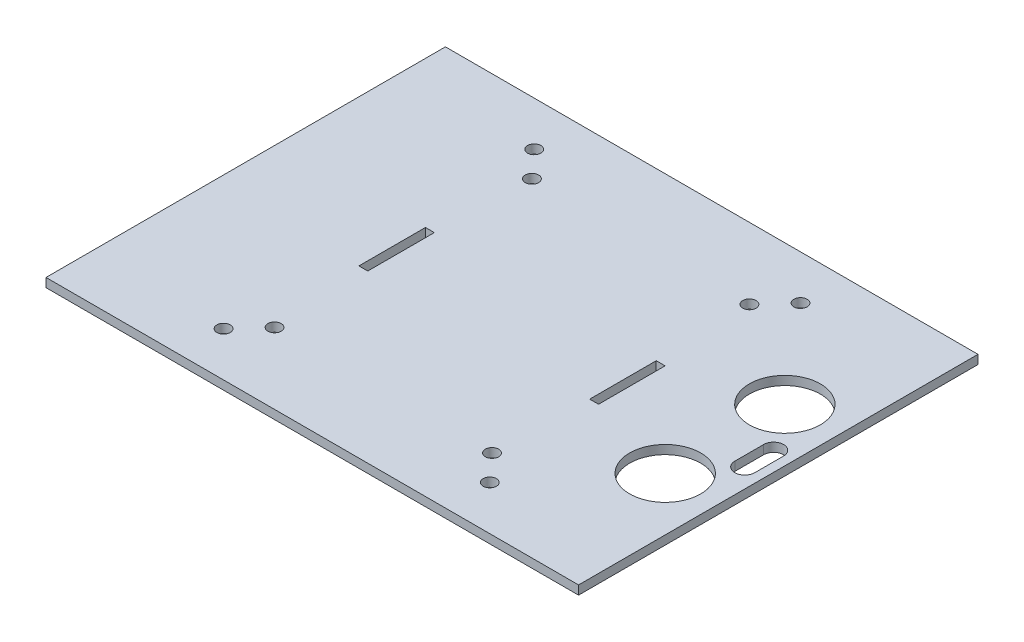
ISO-10303-21;
HEADER;
FILE_DESCRIPTION(('STEP AP214'),'2;1');
FILE_NAME('part.step','',(''),(''),'','','');
FILE_SCHEMA(('AUTOMOTIVE_DESIGN { 1 0 10303 214 1 1 1 1 }'));
ENDSEC;
DATA;
#1=APPLICATION_CONTEXT('core data for automotive mechanical design processes');
#2=APPLICATION_PROTOCOL_DEFINITION('international standard','automotive_design',2000,#1);
#3=PRODUCT_CONTEXT('',#1,'mechanical');
#4=PRODUCT('Part','Part','',(#3));
#5=PRODUCT_RELATED_PRODUCT_CATEGORY('part','',(#4));
#6=PRODUCT_DEFINITION_FORMATION('','',#4);
#7=PRODUCT_DEFINITION_CONTEXT('part definition',#1,'design');
#8=PRODUCT_DEFINITION('design','',#6,#7);
#9=PRODUCT_DEFINITION_SHAPE('','',#8);
#10=(LENGTH_UNIT() NAMED_UNIT(*) SI_UNIT(.MILLI.,.METRE.));
#11=(NAMED_UNIT(*) PLANE_ANGLE_UNIT() SI_UNIT($,.RADIAN.));
#12=(NAMED_UNIT(*) SI_UNIT($,.STERADIAN.) SOLID_ANGLE_UNIT());
#13=UNCERTAINTY_MEASURE_WITH_UNIT(LENGTH_MEASURE(1.E-05),#10,'distance_accuracy_value','');
#14=(GEOMETRIC_REPRESENTATION_CONTEXT(3) GLOBAL_UNCERTAINTY_ASSIGNED_CONTEXT((#13)) GLOBAL_UNIT_ASSIGNED_CONTEXT((#10,
#11,#12)) REPRESENTATION_CONTEXT('',''));
#15=CARTESIAN_POINT('',(0.,0.,0.));
#16=DIRECTION('',(0.,0.,1.));
#17=DIRECTION('',(1.,0.,0.));
#18=AXIS2_PLACEMENT_3D('',#15,#16,#17);
#19=CARTESIAN_POINT('',(0.,2.,0.));
#20=DIRECTION('',(0.,-1.,0.));
#21=DIRECTION('',(0.,0.,-1.));
#22=AXIS2_PLACEMENT_3D('',#19,#20,#21);
#23=PLANE('',#22);
#24=DIRECTION('',(0.,0.,-1.));
#25=VECTOR('',#24,1.);
#26=CARTESIAN_POINT('',(57.95,2.,3.25));
#27=LINE('',#26,#25);
#28=CARTESIAN_POINT('',(57.95,2.,3.25));
#29=VERTEX_POINT('',#28);
#30=CARTESIAN_POINT('',(57.95,2.,-3.25));
#31=VERTEX_POINT('',#30);
#32=EDGE_CURVE('E175',#29,#31,#27,.T.);
#33=ORIENTED_EDGE('',*,*,#32,.F.);
#34=CARTESIAN_POINT('',(55.7,2.,3.25));
#35=DIRECTION('',(0.,1.,0.));
#36=DIRECTION('',(0.,0.,1.));
#37=AXIS2_PLACEMENT_3D('',#34,#35,#36);
#38=CIRCLE('',#37,2.25);
#39=CARTESIAN_POINT('',(53.45,2.,3.25));
#40=VERTEX_POINT('',#39);
#41=EDGE_CURVE('E50',#40,#29,#38,.T.);
#42=ORIENTED_EDGE('',*,*,#41,.F.);
#43=DIRECTION('',(0.,0.,1.));
#44=VECTOR('',#43,1.);
#45=CARTESIAN_POINT('',(53.45,2.,3.25));
#46=LINE('',#45,#44);
#47=CARTESIAN_POINT('',(53.45,2.,-3.25));
#48=VERTEX_POINT('',#47);
#49=EDGE_CURVE('E166',#48,#40,#46,.T.);
#50=ORIENTED_EDGE('',*,*,#49,.F.);
#51=CARTESIAN_POINT('',(55.7,2.,-3.25));
#52=DIRECTION('',(0.,1.,0.));
#53=DIRECTION('',(0.,0.,1.));
#54=AXIS2_PLACEMENT_3D('',#51,#52,#53);
#55=CIRCLE('',#54,2.25);
#56=EDGE_CURVE('E169',#31,#48,#55,.T.);
#57=ORIENTED_EDGE('',*,*,#56,.F.);
#58=EDGE_LOOP('',(#33,#42,#50,#57));
#59=FACE_BOUND('',#58,.T.);
#60=CARTESIAN_POINT('',(48.,2.,13.48));
#61=DIRECTION('',(0.,1.,0.));
#62=DIRECTION('',(0.,0.,-1.));
#63=AXIS2_PLACEMENT_3D('',#60,#61,#62);
#64=CIRCLE('',#63,8.);
#65=CARTESIAN_POINT('',(48.,2.,5.48));
#66=VERTEX_POINT('',#65);
#67=EDGE_CURVE('E181',#66,#66,#64,.T.);
#68=ORIENTED_EDGE('',*,*,#67,.F.);
#69=EDGE_LOOP('',(#68));
#70=FACE_BOUND('',#69,.T.);
#71=CARTESIAN_POINT('',(48.,2.,-13.48));
#72=DIRECTION('',(0.,1.,0.));
#73=DIRECTION('',(0.,0.,1.));
#74=AXIS2_PLACEMENT_3D('',#71,#72,#73);
#75=CIRCLE('',#74,8.);
#76=CARTESIAN_POINT('',(48.,2.,-5.48));
#77=VERTEX_POINT('',#76);
#78=EDGE_CURVE('E188',#77,#77,#75,.T.);
#79=ORIENTED_EDGE('',*,*,#78,.F.);
#80=EDGE_LOOP('',(#79));
#81=FACE_BOUND('',#80,.T.);
#82=DIRECTION('',(0.,0.,-1.));
#83=VECTOR('',#82,1.);
#84=CARTESIAN_POINT('',(-25.,2.,7.49999999999999));
#85=LINE('',#84,#83);
#86=CARTESIAN_POINT('',(-25.,2.,7.49999999999999));
#87=VERTEX_POINT('',#86);
#88=CARTESIAN_POINT('',(-25.,2.,-7.49999999999999));
#89=VERTEX_POINT('',#88);
#90=EDGE_CURVE('E228',#87,#89,#85,.T.);
#91=ORIENTED_EDGE('',*,*,#90,.F.);
#92=DIRECTION('',(1.,0.,0.));
#93=VECTOR('',#92,1.);
#94=CARTESIAN_POINT('',(-27.,2.,7.5));
#95=LINE('',#94,#93);
#96=CARTESIAN_POINT('',(-27.,2.,7.5));
#97=VERTEX_POINT('',#96);
#98=EDGE_CURVE('E236',#97,#87,#95,.T.);
#99=ORIENTED_EDGE('',*,*,#98,.F.);
#100=DIRECTION('',(0.,0.,1.));
#101=VECTOR('',#100,1.);
#102=CARTESIAN_POINT('',(-27.,2.,7.5));
#103=LINE('',#102,#101);
#104=CARTESIAN_POINT('',(-27.,2.,-7.5));
#105=VERTEX_POINT('',#104);
#106=EDGE_CURVE('E233',#105,#97,#103,.T.);
#107=ORIENTED_EDGE('',*,*,#106,.F.);
#108=DIRECTION('',(-1.,0.,0.));
#109=VECTOR('',#108,1.);
#110=CARTESIAN_POINT('',(-27.,2.,-7.5));
#111=LINE('',#110,#109);
#112=EDGE_CURVE('E230',#89,#105,#111,.T.);
#113=ORIENTED_EDGE('',*,*,#112,.F.);
#114=EDGE_LOOP('',(#91,#99,#107,#113));
#115=FACE_BOUND('',#114,.T.);
#116=DIRECTION('',(0.,0.,-1.));
#117=VECTOR('',#116,1.);
#118=CARTESIAN_POINT('',(60.,2.,45.));
#119=LINE('',#118,#117);
#120=CARTESIAN_POINT('',(60.,2.,45.));
#121=VERTEX_POINT('',#120);
#122=CARTESIAN_POINT('',(60.,2.,-45.));
#123=VERTEX_POINT('',#122);
#124=EDGE_CURVE('E307',#121,#123,#119,.T.);
#125=ORIENTED_EDGE('',*,*,#124,.T.);
#126=DIRECTION('',(-1.,0.,0.));
#127=VECTOR('',#126,1.);
#128=CARTESIAN_POINT('',(-60.,2.,-45.));
#129=LINE('',#128,#127);
#130=CARTESIAN_POINT('',(-60.,2.,-45.));
#131=VERTEX_POINT('',#130);
#132=EDGE_CURVE('E310',#123,#131,#129,.T.);
#133=ORIENTED_EDGE('',*,*,#132,.T.);
#134=DIRECTION('',(0.,0.,1.));
#135=VECTOR('',#134,1.);
#136=CARTESIAN_POINT('',(-60.,2.,45.));
#137=LINE('',#136,#135);
#138=CARTESIAN_POINT('',(-60.,2.,45.));
#139=VERTEX_POINT('',#138);
#140=EDGE_CURVE('E313',#131,#139,#137,.T.);
#141=ORIENTED_EDGE('',*,*,#140,.T.);
#142=DIRECTION('',(1.,0.,0.));
#143=VECTOR('',#142,1.);
#144=CARTESIAN_POINT('',(-60.,2.,45.));
#145=LINE('',#144,#143);
#146=EDGE_CURVE('E315',#139,#121,#145,.T.);
#147=ORIENTED_EDGE('',*,*,#146,.T.);
#148=EDGE_LOOP('',(#125,#133,#141,#147));
#149=FACE_BOUND('',#148,.T.);
#150=CARTESIAN_POINT('',(-30.,2.,-35.));
#151=DIRECTION('',(0.,1.,0.));
#152=DIRECTION('',(0.,0.,1.));
#153=AXIS2_PLACEMENT_3D('',#150,#151,#152);
#154=CIRCLE('',#153,1.5);
#155=CARTESIAN_POINT('',(-30.,2.,-33.5));
#156=VERTEX_POINT('',#155);
#157=EDGE_CURVE('E301',#156,#156,#154,.T.);
#158=ORIENTED_EDGE('',*,*,#157,.F.);
#159=EDGE_LOOP('',(#158));
#160=FACE_BOUND('',#159,.T.);
#161=CARTESIAN_POINT('',(30.,2.,-35.));
#162=DIRECTION('',(0.,1.,0.));
#163=DIRECTION('',(0.,0.,-1.));
#164=AXIS2_PLACEMENT_3D('',#161,#162,#163);
#165=CIRCLE('',#164,1.50000000000001);
#166=CARTESIAN_POINT('',(30.,2.,-36.5));
#167=VERTEX_POINT('',#166);
#168=EDGE_CURVE('E295',#167,#167,#165,.T.);
#169=ORIENTED_EDGE('',*,*,#168,.F.);
#170=EDGE_LOOP('',(#169));
#171=FACE_BOUND('',#170,.T.);
#172=CARTESIAN_POINT('',(30.,2.,35.));
#173=DIRECTION('',(0.,1.,0.));
#174=DIRECTION('',(0.,0.,1.));
#175=AXIS2_PLACEMENT_3D('',#172,#173,#174);
#176=CIRCLE('',#175,1.50000000000001);
#177=CARTESIAN_POINT('',(30.,2.,36.5));
#178=VERTEX_POINT('',#177);
#179=EDGE_CURVE('E289',#178,#178,#176,.T.);
#180=ORIENTED_EDGE('',*,*,#179,.F.);
#181=EDGE_LOOP('',(#180));
#182=FACE_BOUND('',#181,.T.);
#183=CARTESIAN_POINT('',(-30.,2.,35.));
#184=DIRECTION('',(0.,1.,0.));
#185=DIRECTION('',(0.,0.,-1.));
#186=AXIS2_PLACEMENT_3D('',#183,#184,#185);
#187=CIRCLE('',#186,1.5);
#188=CARTESIAN_POINT('',(-30.,2.,33.5));
#189=VERTEX_POINT('',#188);
#190=EDGE_CURVE('E283',#189,#189,#187,.T.);
#191=ORIENTED_EDGE('',*,*,#190,.F.);
#192=EDGE_LOOP('',(#191));
#193=FACE_BOUND('',#192,.T.);
#194=CARTESIAN_POINT('',(24.5,2.,-29.));
#195=DIRECTION('',(0.,1.,0.));
#196=DIRECTION('',(0.,0.,1.));
#197=AXIS2_PLACEMENT_3D('',#194,#195,#196);
#198=CIRCLE('',#197,1.5);
#199=CARTESIAN_POINT('',(24.5,2.,-27.5));
#200=VERTEX_POINT('',#199);
#201=EDGE_CURVE('E277',#200,#200,#198,.T.);
#202=ORIENTED_EDGE('',*,*,#201,.F.);
#203=EDGE_LOOP('',(#202));
#204=FACE_BOUND('',#203,.T.);
#205=CARTESIAN_POINT('',(24.5,2.,29.));
#206=DIRECTION('',(0.,1.,0.));
#207=DIRECTION('',(0.,0.,1.));
#208=AXIS2_PLACEMENT_3D('',#205,#206,#207);
#209=CIRCLE('',#208,1.5);
#210=CARTESIAN_POINT('',(24.5,2.,30.5));
#211=VERTEX_POINT('',#210);
#212=EDGE_CURVE('E271',#211,#211,#209,.T.);
#213=ORIENTED_EDGE('',*,*,#212,.F.);
#214=EDGE_LOOP('',(#213));
#215=FACE_BOUND('',#214,.T.);
#216=CARTESIAN_POINT('',(-24.5,2.,-29.));
#217=DIRECTION('',(0.,1.,0.));
#218=DIRECTION('',(0.,0.,-1.));
#219=AXIS2_PLACEMENT_3D('',#216,#217,#218);
#220=CIRCLE('',#219,1.49999999999999);
#221=CARTESIAN_POINT('',(-24.5,2.,-30.5));
#222=VERTEX_POINT('',#221);
#223=EDGE_CURVE('E265',#222,#222,#220,.T.);
#224=ORIENTED_EDGE('',*,*,#223,.F.);
#225=EDGE_LOOP('',(#224));
#226=FACE_BOUND('',#225,.T.);
#227=CARTESIAN_POINT('',(-24.5,2.,29.));
#228=DIRECTION('',(0.,1.,0.));
#229=DIRECTION('',(0.,0.,-1.));
#230=AXIS2_PLACEMENT_3D('',#227,#228,#229);
#231=CIRCLE('',#230,1.5);
#232=CARTESIAN_POINT('',(-24.5,2.,27.5));
#233=VERTEX_POINT('',#232);
#234=EDGE_CURVE('E259',#233,#233,#231,.T.);
#235=ORIENTED_EDGE('',*,*,#234,.F.);
#236=EDGE_LOOP('',(#235));
#237=FACE_BOUND('',#236,.T.);
#238=DIRECTION('',(1.,0.,0.));
#239=VECTOR('',#238,1.);
#240=CARTESIAN_POINT('',(27.,2.,7.49999999999999));
#241=LINE('',#240,#239);
#242=CARTESIAN_POINT('',(25.,2.,7.49999999999999));
#243=VERTEX_POINT('',#242);
#244=CARTESIAN_POINT('',(27.,2.,7.49999999999999));
#245=VERTEX_POINT('',#244);
#246=EDGE_CURVE('E197',#243,#245,#241,.T.);
#247=ORIENTED_EDGE('',*,*,#246,.F.);
#248=DIRECTION('',(0.,0.,1.));
#249=VECTOR('',#248,1.);
#250=CARTESIAN_POINT('',(25.,2.,7.49999999999999));
#251=LINE('',#250,#249);
#252=CARTESIAN_POINT('',(25.,2.,-7.49999999999999));
#253=VERTEX_POINT('',#252);
#254=EDGE_CURVE('E205',#253,#243,#251,.T.);
#255=ORIENTED_EDGE('',*,*,#254,.F.);
#256=DIRECTION('',(-1.,0.,0.));
#257=VECTOR('',#256,1.);
#258=CARTESIAN_POINT('',(27.,2.,-7.49999999999999));
#259=LINE('',#258,#257);
#260=CARTESIAN_POINT('',(27.,2.,-7.49999999999999));
#261=VERTEX_POINT('',#260);
#262=EDGE_CURVE('E202',#261,#253,#259,.T.);
#263=ORIENTED_EDGE('',*,*,#262,.F.);
#264=DIRECTION('',(0.,0.,-1.));
#265=VECTOR('',#264,1.);
#266=CARTESIAN_POINT('',(27.,2.,7.49999999999999));
#267=LINE('',#266,#265);
#268=EDGE_CURVE('E199',#245,#261,#267,.T.);
#269=ORIENTED_EDGE('',*,*,#268,.F.);
#270=EDGE_LOOP('',(#247,#255,#263,#269));
#271=FACE_BOUND('',#270,.T.);
#272=ADVANCED_FACE('F35',(#59,#70,#81,#115,#149,#160,#171,#182,#193,#204,#215,#226,#237,#271),
#23,.F.);
#273=CARTESIAN_POINT('',(0.,0.,0.));
#274=DIRECTION('',(0.,-1.,0.));
#275=DIRECTION('',(0.,0.,-1.));
#276=AXIS2_PLACEMENT_3D('',#273,#274,#275);
#277=PLANE('',#276);
#278=CARTESIAN_POINT('',(55.7,0.,3.25));
#279=DIRECTION('',(0.,1.,0.));
#280=DIRECTION('',(0.,0.,1.));
#281=AXIS2_PLACEMENT_3D('',#278,#279,#280);
#282=CIRCLE('',#281,2.25);
#283=CARTESIAN_POINT('',(53.45,0.,3.25));
#284=VERTEX_POINT('',#283);
#285=CARTESIAN_POINT('',(57.95,0.,3.25));
#286=VERTEX_POINT('',#285);
#287=EDGE_CURVE('E150',#284,#286,#282,.T.);
#288=ORIENTED_EDGE('',*,*,#287,.T.);
#289=DIRECTION('',(0.,0.,-1.));
#290=VECTOR('',#289,1.);
#291=CARTESIAN_POINT('',(57.95,0.,3.25));
#292=LINE('',#291,#290);
#293=CARTESIAN_POINT('',(57.95,0.,-3.25));
#294=VERTEX_POINT('',#293);
#295=EDGE_CURVE('E159',#286,#294,#292,.T.);
#296=ORIENTED_EDGE('',*,*,#295,.T.);
#297=CARTESIAN_POINT('',(55.7,0.,-3.25));
#298=DIRECTION('',(0.,1.,0.));
#299=DIRECTION('',(0.,0.,1.));
#300=AXIS2_PLACEMENT_3D('',#297,#298,#299);
#301=CIRCLE('',#300,2.25);
#302=CARTESIAN_POINT('',(53.45,0.,-3.25));
#303=VERTEX_POINT('',#302);
#304=EDGE_CURVE('E58',#294,#303,#301,.T.);
#305=ORIENTED_EDGE('',*,*,#304,.T.);
#306=DIRECTION('',(0.,0.,1.));
#307=VECTOR('',#306,1.);
#308=CARTESIAN_POINT('',(53.45,0.,3.25));
#309=LINE('',#308,#307);
#310=EDGE_CURVE('E156',#303,#284,#309,.T.);
#311=ORIENTED_EDGE('',*,*,#310,.T.);
#312=EDGE_LOOP('',(#288,#296,#305,#311));
#313=FACE_BOUND('',#312,.T.);
#314=CARTESIAN_POINT('',(48.,0.,13.48));
#315=DIRECTION('',(0.,1.,0.));
#316=DIRECTION('',(0.,0.,-1.));
#317=AXIS2_PLACEMENT_3D('',#314,#315,#316);
#318=CIRCLE('',#317,8.);
#319=CARTESIAN_POINT('',(48.,0.,5.48));
#320=VERTEX_POINT('',#319);
#321=EDGE_CURVE('E185',#320,#320,#318,.T.);
#322=ORIENTED_EDGE('',*,*,#321,.T.);
#323=EDGE_LOOP('',(#322));
#324=FACE_BOUND('',#323,.T.);
#325=CARTESIAN_POINT('',(48.,0.,-13.48));
#326=DIRECTION('',(0.,1.,0.));
#327=DIRECTION('',(0.,0.,1.));
#328=AXIS2_PLACEMENT_3D('',#325,#326,#327);
#329=CIRCLE('',#328,8.);
#330=CARTESIAN_POINT('',(48.,0.,-5.48));
#331=VERTEX_POINT('',#330);
#332=EDGE_CURVE('E191',#331,#331,#329,.T.);
#333=ORIENTED_EDGE('',*,*,#332,.T.);
#334=EDGE_LOOP('',(#333));
#335=FACE_BOUND('',#334,.T.);
#336=CARTESIAN_POINT('',(-24.5,0.,-29.));
#337=DIRECTION('',(0.,1.,0.));
#338=DIRECTION('',(0.,0.,-1.));
#339=AXIS2_PLACEMENT_3D('',#336,#337,#338);
#340=CIRCLE('',#339,1.49999999999999);
#341=CARTESIAN_POINT('',(-24.5,0.,-30.5));
#342=VERTEX_POINT('',#341);
#343=EDGE_CURVE('E262',#342,#342,#340,.T.);
#344=ORIENTED_EDGE('',*,*,#343,.T.);
#345=EDGE_LOOP('',(#344));
#346=FACE_BOUND('',#345,.T.);
#347=CARTESIAN_POINT('',(24.5,0.,-29.));
#348=DIRECTION('',(0.,1.,0.));
#349=DIRECTION('',(0.,0.,1.));
#350=AXIS2_PLACEMENT_3D('',#347,#348,#349);
#351=CIRCLE('',#350,1.5);
#352=CARTESIAN_POINT('',(24.5,0.,-27.5));
#353=VERTEX_POINT('',#352);
#354=EDGE_CURVE('E274',#353,#353,#351,.T.);
#355=ORIENTED_EDGE('',*,*,#354,.T.);
#356=EDGE_LOOP('',(#355));
#357=FACE_BOUND('',#356,.T.);
#358=CARTESIAN_POINT('',(30.,0.,35.));
#359=DIRECTION('',(0.,1.,0.));
#360=DIRECTION('',(0.,0.,1.));
#361=AXIS2_PLACEMENT_3D('',#358,#359,#360);
#362=CIRCLE('',#361,1.50000000000001);
#363=CARTESIAN_POINT('',(30.,0.,36.5));
#364=VERTEX_POINT('',#363);
#365=EDGE_CURVE('E286',#364,#364,#362,.T.);
#366=ORIENTED_EDGE('',*,*,#365,.T.);
#367=EDGE_LOOP('',(#366));
#368=FACE_BOUND('',#367,.T.);
#369=CARTESIAN_POINT('',(-30.,0.,-35.));
#370=DIRECTION('',(0.,1.,0.));
#371=DIRECTION('',(0.,0.,1.));
#372=AXIS2_PLACEMENT_3D('',#369,#370,#371);
#373=CIRCLE('',#372,1.5);
#374=CARTESIAN_POINT('',(-30.,0.,-33.5));
#375=VERTEX_POINT('',#374);
#376=EDGE_CURVE('E298',#375,#375,#373,.T.);
#377=ORIENTED_EDGE('',*,*,#376,.T.);
#378=EDGE_LOOP('',(#377));
#379=FACE_BOUND('',#378,.T.);
#380=DIRECTION('',(0.,0.,-1.));
#381=VECTOR('',#380,1.);
#382=CARTESIAN_POINT('',(60.,0.,45.));
#383=LINE('',#382,#381);
#384=CARTESIAN_POINT('',(60.,0.,45.));
#385=VERTEX_POINT('',#384);
#386=CARTESIAN_POINT('',(60.,0.,-45.));
#387=VERTEX_POINT('',#386);
#388=EDGE_CURVE('E304',#385,#387,#383,.T.);
#389=ORIENTED_EDGE('',*,*,#388,.F.);
#390=DIRECTION('',(1.,0.,0.));
#391=VECTOR('',#390,1.);
#392=CARTESIAN_POINT('',(-60.,0.,45.));
#393=LINE('',#392,#391);
#394=CARTESIAN_POINT('',(-60.,0.,45.));
#395=VERTEX_POINT('',#394);
#396=EDGE_CURVE('E311',#395,#385,#393,.T.);
#397=ORIENTED_EDGE('',*,*,#396,.F.);
#398=DIRECTION('',(0.,0.,1.));
#399=VECTOR('',#398,1.);
#400=CARTESIAN_POINT('',(-60.,0.,45.));
#401=LINE('',#400,#399);
#402=CARTESIAN_POINT('',(-60.,0.,-45.));
#403=VERTEX_POINT('',#402);
#404=EDGE_CURVE('E322',#403,#395,#401,.T.);
#405=ORIENTED_EDGE('',*,*,#404,.F.);
#406=DIRECTION('',(-1.,0.,0.));
#407=VECTOR('',#406,1.);
#408=CARTESIAN_POINT('',(-60.,0.,-45.));
#409=LINE('',#408,#407);
#410=EDGE_CURVE('E320',#387,#403,#409,.T.);
#411=ORIENTED_EDGE('',*,*,#410,.F.);
#412=EDGE_LOOP('',(#389,#397,#405,#411));
#413=FACE_BOUND('',#412,.T.);
#414=CARTESIAN_POINT('',(30.,0.,-35.));
#415=DIRECTION('',(0.,1.,0.));
#416=DIRECTION('',(0.,0.,-1.));
#417=AXIS2_PLACEMENT_3D('',#414,#415,#416);
#418=CIRCLE('',#417,1.50000000000001);
#419=CARTESIAN_POINT('',(30.,0.,-36.5));
#420=VERTEX_POINT('',#419);
#421=EDGE_CURVE('E292',#420,#420,#418,.T.);
#422=ORIENTED_EDGE('',*,*,#421,.T.);
#423=EDGE_LOOP('',(#422));
#424=FACE_BOUND('',#423,.T.);
#425=CARTESIAN_POINT('',(-30.,0.,35.));
#426=DIRECTION('',(0.,1.,0.));
#427=DIRECTION('',(0.,0.,-1.));
#428=AXIS2_PLACEMENT_3D('',#425,#426,#427);
#429=CIRCLE('',#428,1.5);
#430=CARTESIAN_POINT('',(-30.,0.,33.5));
#431=VERTEX_POINT('',#430);
#432=EDGE_CURVE('E280',#431,#431,#429,.T.);
#433=ORIENTED_EDGE('',*,*,#432,.T.);
#434=EDGE_LOOP('',(#433));
#435=FACE_BOUND('',#434,.T.);
#436=CARTESIAN_POINT('',(24.5,0.,29.));
#437=DIRECTION('',(0.,1.,0.));
#438=DIRECTION('',(0.,0.,1.));
#439=AXIS2_PLACEMENT_3D('',#436,#437,#438);
#440=CIRCLE('',#439,1.5);
#441=CARTESIAN_POINT('',(24.5,0.,30.5));
#442=VERTEX_POINT('',#441);
#443=EDGE_CURVE('E268',#442,#442,#440,.T.);
#444=ORIENTED_EDGE('',*,*,#443,.T.);
#445=EDGE_LOOP('',(#444));
#446=FACE_BOUND('',#445,.T.);
#447=CARTESIAN_POINT('',(-24.5,0.,29.));
#448=DIRECTION('',(0.,1.,0.));
#449=DIRECTION('',(0.,0.,-1.));
#450=AXIS2_PLACEMENT_3D('',#447,#448,#449);
#451=CIRCLE('',#450,1.5);
#452=CARTESIAN_POINT('',(-24.5,0.,27.5));
#453=VERTEX_POINT('',#452);
#454=EDGE_CURVE('E258',#453,#453,#451,.T.);
#455=ORIENTED_EDGE('',*,*,#454,.T.);
#456=EDGE_LOOP('',(#455));
#457=FACE_BOUND('',#456,.T.);
#458=DIRECTION('',(1.,0.,0.));
#459=VECTOR('',#458,1.);
#460=CARTESIAN_POINT('',(-27.,0.,7.5));
#461=LINE('',#460,#459);
#462=CARTESIAN_POINT('',(-27.,0.,7.5));
#463=VERTEX_POINT('',#462);
#464=CARTESIAN_POINT('',(-25.,0.,7.49999999999999));
#465=VERTEX_POINT('',#464);
#466=EDGE_CURVE('E231',#463,#465,#461,.T.);
#467=ORIENTED_EDGE('',*,*,#466,.T.);
#468=DIRECTION('',(0.,0.,-1.));
#469=VECTOR('',#468,1.);
#470=CARTESIAN_POINT('',(-25.,0.,7.49999999999999));
#471=LINE('',#470,#469);
#472=CARTESIAN_POINT('',(-25.,0.,-7.49999999999999));
#473=VERTEX_POINT('',#472);
#474=EDGE_CURVE('E227',#465,#473,#471,.T.);
#475=ORIENTED_EDGE('',*,*,#474,.T.);
#476=DIRECTION('',(-1.,0.,0.));
#477=VECTOR('',#476,1.);
#478=CARTESIAN_POINT('',(-27.,0.,-7.5));
#479=LINE('',#478,#477);
#480=CARTESIAN_POINT('',(-27.,0.,-7.5));
#481=VERTEX_POINT('',#480);
#482=EDGE_CURVE('E241',#473,#481,#479,.T.);
#483=ORIENTED_EDGE('',*,*,#482,.T.);
#484=DIRECTION('',(0.,0.,1.));
#485=VECTOR('',#484,1.);
#486=CARTESIAN_POINT('',(-27.,0.,7.5));
#487=LINE('',#486,#485);
#488=EDGE_CURVE('E244',#481,#463,#487,.T.);
#489=ORIENTED_EDGE('',*,*,#488,.T.);
#490=EDGE_LOOP('',(#467,#475,#483,#489));
#491=FACE_BOUND('',#490,.T.);
#492=DIRECTION('',(0.,0.,1.));
#493=VECTOR('',#492,1.);
#494=CARTESIAN_POINT('',(25.,0.,7.49999999999999));
#495=LINE('',#494,#493);
#496=CARTESIAN_POINT('',(25.,0.,-7.49999999999999));
#497=VERTEX_POINT('',#496);
#498=CARTESIAN_POINT('',(25.,0.,7.49999999999999));
#499=VERTEX_POINT('',#498);
#500=EDGE_CURVE('E200',#497,#499,#495,.T.);
#501=ORIENTED_EDGE('',*,*,#500,.T.);
#502=DIRECTION('',(1.,0.,0.));
#503=VECTOR('',#502,1.);
#504=CARTESIAN_POINT('',(27.,0.,7.49999999999999));
#505=LINE('',#504,#503);
#506=CARTESIAN_POINT('',(27.,0.,7.49999999999999));
#507=VERTEX_POINT('',#506);
#508=EDGE_CURVE('E194',#499,#507,#505,.T.);
#509=ORIENTED_EDGE('',*,*,#508,.T.);
#510=DIRECTION('',(0.,0.,-1.));
#511=VECTOR('',#510,1.);
#512=CARTESIAN_POINT('',(27.,0.,7.49999999999999));
#513=LINE('',#512,#511);
#514=CARTESIAN_POINT('',(27.,0.,-7.49999999999999));
#515=VERTEX_POINT('',#514);
#516=EDGE_CURVE('E210',#507,#515,#513,.T.);
#517=ORIENTED_EDGE('',*,*,#516,.T.);
#518=DIRECTION('',(-1.,0.,0.));
#519=VECTOR('',#518,1.);
#520=CARTESIAN_POINT('',(27.,0.,-7.49999999999999));
#521=LINE('',#520,#519);
#522=EDGE_CURVE('E213',#515,#497,#521,.T.);
#523=ORIENTED_EDGE('',*,*,#522,.T.);
#524=EDGE_LOOP('',(#501,#509,#517,#523));
#525=FACE_BOUND('',#524,.T.);
#526=ADVANCED_FACE('F163',(#313,#324,#335,#346,#357,#368,#379,#413,#424,#435,#446,#457,#491,
#525),#277,.T.);
#527=CARTESIAN_POINT('',(60.,2.,45.));
#528=DIRECTION('',(-1.,0.,0.));
#529=DIRECTION('',(0.,0.,1.));
#530=AXIS2_PLACEMENT_3D('',#527,#528,#529);
#531=PLANE('',#530);
#532=ORIENTED_EDGE('',*,*,#388,.T.);
#533=DIRECTION('',(0.,-1.,0.));
#534=VECTOR('',#533,1.);
#535=CARTESIAN_POINT('',(60.,2.,-45.));
#536=LINE('',#535,#534);
#537=EDGE_CURVE('E11',#123,#387,#536,.T.);
#538=ORIENTED_EDGE('',*,*,#537,.F.);
#539=ORIENTED_EDGE('',*,*,#124,.F.);
#540=DIRECTION('',(0.,-1.,0.));
#541=VECTOR('',#540,1.);
#542=CARTESIAN_POINT('',(60.,2.,45.));
#543=LINE('',#542,#541);
#544=EDGE_CURVE('E317',#121,#385,#543,.T.);
#545=ORIENTED_EDGE('',*,*,#544,.T.);
#546=EDGE_LOOP('',(#532,#538,#539,#545));
#547=FACE_BOUND('',#546,.T.);
#548=ADVANCED_FACE('F37',(#547),#531,.F.);
#549=CARTESIAN_POINT('',(-60.,2.,-45.));
#550=DIRECTION('',(0.,0.,1.));
#551=DIRECTION('',(1.,0.,0.));
#552=AXIS2_PLACEMENT_3D('',#549,#550,#551);
#553=PLANE('',#552);
#554=ORIENTED_EDGE('',*,*,#410,.T.);
#555=DIRECTION('',(0.,-1.,0.));
#556=VECTOR('',#555,1.);
#557=CARTESIAN_POINT('',(-60.,2.,-45.));
#558=LINE('',#557,#556);
#559=EDGE_CURVE('E43',#131,#403,#558,.T.);
#560=ORIENTED_EDGE('',*,*,#559,.F.);
#561=ORIENTED_EDGE('',*,*,#132,.F.);
#562=ORIENTED_EDGE('',*,*,#537,.T.);
#563=EDGE_LOOP('',(#554,#560,#561,#562));
#564=FACE_BOUND('',#563,.T.);
#565=ADVANCED_FACE('F350',(#564),#553,.F.);
#566=CARTESIAN_POINT('',(-60.,2.,45.));
#567=DIRECTION('',(1.,0.,0.));
#568=DIRECTION('',(0.,0.,-1.));
#569=AXIS2_PLACEMENT_3D('',#566,#567,#568);
#570=PLANE('',#569);
#571=ORIENTED_EDGE('',*,*,#404,.T.);
#572=DIRECTION('',(0.,-1.,0.));
#573=VECTOR('',#572,1.);
#574=CARTESIAN_POINT('',(-60.,2.,45.));
#575=LINE('',#574,#573);
#576=EDGE_CURVE('E327',#139,#395,#575,.T.);
#577=ORIENTED_EDGE('',*,*,#576,.F.);
#578=ORIENTED_EDGE('',*,*,#140,.F.);
#579=ORIENTED_EDGE('',*,*,#559,.T.);
#580=EDGE_LOOP('',(#571,#577,#578,#579));
#581=FACE_BOUND('',#580,.T.);
#582=ADVANCED_FACE('F334',(#581),#570,.F.);
#583=CARTESIAN_POINT('',(-60.,2.,45.));
#584=DIRECTION('',(0.,0.,-1.));
#585=DIRECTION('',(-1.,0.,0.));
#586=AXIS2_PLACEMENT_3D('',#583,#584,#585);
#587=PLANE('',#586);
#588=ORIENTED_EDGE('',*,*,#396,.T.);
#589=ORIENTED_EDGE('',*,*,#544,.F.);
#590=ORIENTED_EDGE('',*,*,#146,.F.);
#591=ORIENTED_EDGE('',*,*,#576,.T.);
#592=EDGE_LOOP('',(#588,#589,#590,#591));
#593=FACE_BOUND('',#592,.T.);
#594=ADVANCED_FACE('F343',(#593),#587,.F.);
#595=CARTESIAN_POINT('',(-30.,2.,-35.));
#596=DIRECTION('',(0.,-1.,0.));
#597=DIRECTION('',(0.,0.,-1.));
#598=AXIS2_PLACEMENT_3D('',#595,#596,#597);
#599=CYLINDRICAL_SURFACE('',#598,1.5);
#600=ORIENTED_EDGE('',*,*,#157,.T.);
#601=EDGE_LOOP('',(#600));
#602=FACE_BOUND('',#601,.T.);
#603=ORIENTED_EDGE('',*,*,#376,.F.);
#604=EDGE_LOOP('',(#603));
#605=FACE_BOUND('',#604,.T.);
#606=ADVANCED_FACE('F366',(#602,#605),#599,.F.);
#607=CARTESIAN_POINT('',(30.,2.,-35.));
#608=DIRECTION('',(0.,-1.,0.));
#609=DIRECTION('',(0.,0.,-1.));
#610=AXIS2_PLACEMENT_3D('',#607,#608,#609);
#611=CYLINDRICAL_SURFACE('',#610,1.50000000000001);
#612=ORIENTED_EDGE('',*,*,#168,.T.);
#613=EDGE_LOOP('',(#612));
#614=FACE_BOUND('',#613,.T.);
#615=ORIENTED_EDGE('',*,*,#421,.F.);
#616=EDGE_LOOP('',(#615));
#617=FACE_BOUND('',#616,.T.);
#618=ADVANCED_FACE('F373',(#614,#617),#611,.F.);
#619=CARTESIAN_POINT('',(30.,2.,35.));
#620=DIRECTION('',(0.,-1.,0.));
#621=DIRECTION('',(0.,0.,-1.));
#622=AXIS2_PLACEMENT_3D('',#619,#620,#621);
#623=CYLINDRICAL_SURFACE('',#622,1.50000000000001);
#624=ORIENTED_EDGE('',*,*,#179,.T.);
#625=EDGE_LOOP('',(#624));
#626=FACE_BOUND('',#625,.T.);
#627=ORIENTED_EDGE('',*,*,#365,.F.);
#628=EDGE_LOOP('',(#627));
#629=FACE_BOUND('',#628,.T.);
#630=ADVANCED_FACE('F378',(#626,#629),#623,.F.);
#631=CARTESIAN_POINT('',(-30.,2.,35.));
#632=DIRECTION('',(0.,-1.,0.));
#633=DIRECTION('',(0.,0.,-1.));
#634=AXIS2_PLACEMENT_3D('',#631,#632,#633);
#635=CYLINDRICAL_SURFACE('',#634,1.5);
#636=ORIENTED_EDGE('',*,*,#190,.T.);
#637=EDGE_LOOP('',(#636));
#638=FACE_BOUND('',#637,.T.);
#639=ORIENTED_EDGE('',*,*,#432,.F.);
#640=EDGE_LOOP('',(#639));
#641=FACE_BOUND('',#640,.T.);
#642=ADVANCED_FACE('F461',(#638,#641),#635,.F.);
#643=CARTESIAN_POINT('',(24.5,2.,-29.));
#644=DIRECTION('',(0.,-1.,0.));
#645=DIRECTION('',(0.,0.,-1.));
#646=AXIS2_PLACEMENT_3D('',#643,#644,#645);
#647=CYLINDRICAL_SURFACE('',#646,1.5);
#648=ORIENTED_EDGE('',*,*,#201,.T.);
#649=EDGE_LOOP('',(#648));
#650=FACE_BOUND('',#649,.T.);
#651=ORIENTED_EDGE('',*,*,#354,.F.);
#652=EDGE_LOOP('',(#651));
#653=FACE_BOUND('',#652,.T.);
#654=ADVANCED_FACE('F457',(#650,#653),#647,.F.);
#655=CARTESIAN_POINT('',(24.5,2.,29.));
#656=DIRECTION('',(0.,-1.,0.));
#657=DIRECTION('',(0.,0.,-1.));
#658=AXIS2_PLACEMENT_3D('',#655,#656,#657);
#659=CYLINDRICAL_SURFACE('',#658,1.5);
#660=ORIENTED_EDGE('',*,*,#212,.T.);
#661=EDGE_LOOP('',(#660));
#662=FACE_BOUND('',#661,.T.);
#663=ORIENTED_EDGE('',*,*,#443,.F.);
#664=EDGE_LOOP('',(#663));
#665=FACE_BOUND('',#664,.T.);
#666=ADVANCED_FACE('F453',(#662,#665),#659,.F.);
#667=CARTESIAN_POINT('',(-24.5,2.,-29.));
#668=DIRECTION('',(0.,-1.,0.));
#669=DIRECTION('',(0.,0.,-1.));
#670=AXIS2_PLACEMENT_3D('',#667,#668,#669);
#671=CYLINDRICAL_SURFACE('',#670,1.49999999999999);
#672=ORIENTED_EDGE('',*,*,#223,.T.);
#673=EDGE_LOOP('',(#672));
#674=FACE_BOUND('',#673,.T.);
#675=ORIENTED_EDGE('',*,*,#343,.F.);
#676=EDGE_LOOP('',(#675));
#677=FACE_BOUND('',#676,.T.);
#678=ADVANCED_FACE('F449',(#674,#677),#671,.F.);
#679=CARTESIAN_POINT('',(-24.5,2.,29.));
#680=DIRECTION('',(0.,-1.,0.));
#681=DIRECTION('',(0.,0.,-1.));
#682=AXIS2_PLACEMENT_3D('',#679,#680,#681);
#683=CYLINDRICAL_SURFACE('',#682,1.5);
#684=ORIENTED_EDGE('',*,*,#234,.T.);
#685=EDGE_LOOP('',(#684));
#686=FACE_BOUND('',#685,.T.);
#687=ORIENTED_EDGE('',*,*,#454,.F.);
#688=EDGE_LOOP('',(#687));
#689=FACE_BOUND('',#688,.T.);
#690=ADVANCED_FACE('F445',(#686,#689),#683,.F.);
#691=CARTESIAN_POINT('',(-25.,2.,7.49999999999999));
#692=DIRECTION('',(-1.,0.,0.));
#693=DIRECTION('',(0.,0.,1.));
#694=AXIS2_PLACEMENT_3D('',#691,#692,#693);
#695=PLANE('',#694);
#696=ORIENTED_EDGE('',*,*,#474,.F.);
#697=DIRECTION('',(0.,-1.,0.));
#698=VECTOR('',#697,1.);
#699=CARTESIAN_POINT('',(-25.,2.,7.49999999999999));
#700=LINE('',#699,#698);
#701=EDGE_CURVE('E238',#87,#465,#700,.T.);
#702=ORIENTED_EDGE('',*,*,#701,.F.);
#703=ORIENTED_EDGE('',*,*,#90,.T.);
#704=DIRECTION('',(0.,-1.,0.));
#705=VECTOR('',#704,1.);
#706=CARTESIAN_POINT('',(-25.,2.,-7.49999999999999));
#707=LINE('',#706,#705);
#708=EDGE_CURVE('E255',#89,#473,#707,.T.);
#709=ORIENTED_EDGE('',*,*,#708,.T.);
#710=EDGE_LOOP('',(#696,#702,#703,#709));
#711=FACE_BOUND('',#710,.T.);
#712=ADVANCED_FACE('F441',(#711),#695,.T.);
#713=CARTESIAN_POINT('',(-27.,2.,-7.5));
#714=DIRECTION('',(0.,0.,1.));
#715=DIRECTION('',(1.,0.,0.));
#716=AXIS2_PLACEMENT_3D('',#713,#714,#715);
#717=PLANE('',#716);
#718=ORIENTED_EDGE('',*,*,#482,.F.);
#719=ORIENTED_EDGE('',*,*,#708,.F.);
#720=ORIENTED_EDGE('',*,*,#112,.T.);
#721=DIRECTION('',(0.,-1.,0.));
#722=VECTOR('',#721,1.);
#723=CARTESIAN_POINT('',(-27.,2.,-7.5));
#724=LINE('',#723,#722);
#725=EDGE_CURVE('E253',#105,#481,#724,.T.);
#726=ORIENTED_EDGE('',*,*,#725,.T.);
#727=EDGE_LOOP('',(#718,#719,#720,#726));
#728=FACE_BOUND('',#727,.T.);
#729=ADVANCED_FACE('F437',(#728),#717,.T.);
#730=CARTESIAN_POINT('',(-27.,2.,7.5));
#731=DIRECTION('',(1.,0.,0.));
#732=DIRECTION('',(0.,0.,-1.));
#733=AXIS2_PLACEMENT_3D('',#730,#731,#732);
#734=PLANE('',#733);
#735=ORIENTED_EDGE('',*,*,#488,.F.);
#736=ORIENTED_EDGE('',*,*,#725,.F.);
#737=ORIENTED_EDGE('',*,*,#106,.T.);
#738=DIRECTION('',(0.,-1.,0.));
#739=VECTOR('',#738,1.);
#740=CARTESIAN_POINT('',(-27.,2.,7.5));
#741=LINE('',#740,#739);
#742=EDGE_CURVE('E251',#97,#463,#741,.T.);
#743=ORIENTED_EDGE('',*,*,#742,.T.);
#744=EDGE_LOOP('',(#735,#736,#737,#743));
#745=FACE_BOUND('',#744,.T.);
#746=ADVANCED_FACE('F433',(#745),#734,.T.);
#747=CARTESIAN_POINT('',(-27.,2.,7.5));
#748=DIRECTION('',(0.,0.,-1.));
#749=DIRECTION('',(-1.,0.,0.));
#750=AXIS2_PLACEMENT_3D('',#747,#748,#749);
#751=PLANE('',#750);
#752=ORIENTED_EDGE('',*,*,#466,.F.);
#753=ORIENTED_EDGE('',*,*,#742,.F.);
#754=ORIENTED_EDGE('',*,*,#98,.T.);
#755=ORIENTED_EDGE('',*,*,#701,.T.);
#756=EDGE_LOOP('',(#752,#753,#754,#755));
#757=FACE_BOUND('',#756,.T.);
#758=ADVANCED_FACE('F430',(#757),#751,.T.);
#759=CARTESIAN_POINT('',(27.,2.,7.49999999999999));
#760=DIRECTION('',(0.,0.,-1.));
#761=DIRECTION('',(-1.,0.,0.));
#762=AXIS2_PLACEMENT_3D('',#759,#760,#761);
#763=PLANE('',#762);
#764=ORIENTED_EDGE('',*,*,#508,.F.);
#765=DIRECTION('',(0.,-1.,0.));
#766=VECTOR('',#765,1.);
#767=CARTESIAN_POINT('',(25.,2.,7.49999999999999));
#768=LINE('',#767,#766);
#769=EDGE_CURVE('E207',#243,#499,#768,.T.);
#770=ORIENTED_EDGE('',*,*,#769,.F.);
#771=ORIENTED_EDGE('',*,*,#246,.T.);
#772=DIRECTION('',(0.,-1.,0.));
#773=VECTOR('',#772,1.);
#774=CARTESIAN_POINT('',(27.,2.,7.49999999999999));
#775=LINE('',#774,#773);
#776=EDGE_CURVE('E224',#245,#507,#775,.T.);
#777=ORIENTED_EDGE('',*,*,#776,.T.);
#778=EDGE_LOOP('',(#764,#770,#771,#777));
#779=FACE_BOUND('',#778,.T.);
#780=ADVANCED_FACE('F406',(#779),#763,.T.);
#781=CARTESIAN_POINT('',(27.,2.,7.49999999999999));
#782=DIRECTION('',(-1.,0.,0.));
#783=DIRECTION('',(0.,0.,1.));
#784=AXIS2_PLACEMENT_3D('',#781,#782,#783);
#785=PLANE('',#784);
#786=ORIENTED_EDGE('',*,*,#516,.F.);
#787=ORIENTED_EDGE('',*,*,#776,.F.);
#788=ORIENTED_EDGE('',*,*,#268,.T.);
#789=DIRECTION('',(0.,-1.,0.));
#790=VECTOR('',#789,1.);
#791=CARTESIAN_POINT('',(27.,2.,-7.49999999999999));
#792=LINE('',#791,#790);
#793=EDGE_CURVE('E222',#261,#515,#792,.T.);
#794=ORIENTED_EDGE('',*,*,#793,.T.);
#795=EDGE_LOOP('',(#786,#787,#788,#794));
#796=FACE_BOUND('',#795,.T.);
#797=ADVANCED_FACE('F408',(#796),#785,.T.);
#798=CARTESIAN_POINT('',(27.,2.,-7.49999999999999));
#799=DIRECTION('',(0.,0.,1.));
#800=DIRECTION('',(1.,0.,0.));
#801=AXIS2_PLACEMENT_3D('',#798,#799,#800);
#802=PLANE('',#801);
#803=ORIENTED_EDGE('',*,*,#522,.F.);
#804=ORIENTED_EDGE('',*,*,#793,.F.);
#805=ORIENTED_EDGE('',*,*,#262,.T.);
#806=DIRECTION('',(0.,-1.,0.));
#807=VECTOR('',#806,1.);
#808=CARTESIAN_POINT('',(25.,2.,-7.49999999999999));
#809=LINE('',#808,#807);
#810=EDGE_CURVE('E220',#253,#497,#809,.T.);
#811=ORIENTED_EDGE('',*,*,#810,.T.);
#812=EDGE_LOOP('',(#803,#804,#805,#811));
#813=FACE_BOUND('',#812,.T.);
#814=ADVANCED_FACE('F416',(#813),#802,.T.);
#815=CARTESIAN_POINT('',(25.,2.,7.49999999999999));
#816=DIRECTION('',(1.,0.,0.));
#817=DIRECTION('',(0.,0.,-1.));
#818=AXIS2_PLACEMENT_3D('',#815,#816,#817);
#819=PLANE('',#818);
#820=ORIENTED_EDGE('',*,*,#500,.F.);
#821=ORIENTED_EDGE('',*,*,#810,.F.);
#822=ORIENTED_EDGE('',*,*,#254,.T.);
#823=ORIENTED_EDGE('',*,*,#769,.T.);
#824=EDGE_LOOP('',(#820,#821,#822,#823));
#825=FACE_BOUND('',#824,.T.);
#826=ADVANCED_FACE('F414',(#825),#819,.T.);
#827=CARTESIAN_POINT('',(48.,0.,-13.48));
#828=DIRECTION('',(0.,1.,0.));
#829=DIRECTION('',(0.,0.,1.));
#830=AXIS2_PLACEMENT_3D('',#827,#828,#829);
#831=CYLINDRICAL_SURFACE('',#830,8.);
#832=ORIENTED_EDGE('',*,*,#332,.F.);
#833=EDGE_LOOP('',(#832));
#834=FACE_BOUND('',#833,.T.);
#835=ORIENTED_EDGE('',*,*,#78,.T.);
#836=EDGE_LOOP('',(#835));
#837=FACE_BOUND('',#836,.T.);
#838=ADVANCED_FACE('F423',(#834,#837),#831,.F.);
#839=CARTESIAN_POINT('',(48.,0.,13.48));
#840=DIRECTION('',(0.,1.,0.));
#841=DIRECTION('',(0.,0.,1.));
#842=AXIS2_PLACEMENT_3D('',#839,#840,#841);
#843=CYLINDRICAL_SURFACE('',#842,8.);
#844=ORIENTED_EDGE('',*,*,#321,.F.);
#845=EDGE_LOOP('',(#844));
#846=FACE_BOUND('',#845,.T.);
#847=ORIENTED_EDGE('',*,*,#67,.T.);
#848=EDGE_LOOP('',(#847));
#849=FACE_BOUND('',#848,.T.);
#850=ADVANCED_FACE('F549',(#846,#849),#843,.F.);
#851=CARTESIAN_POINT('',(55.7,0.,3.25));
#852=DIRECTION('',(0.,1.,0.));
#853=DIRECTION('',(0.,0.,1.));
#854=AXIS2_PLACEMENT_3D('',#851,#852,#853);
#855=CYLINDRICAL_SURFACE('',#854,2.25);
#856=ORIENTED_EDGE('',*,*,#41,.T.);
#857=DIRECTION('',(0.,1.,0.));
#858=VECTOR('',#857,1.);
#859=CARTESIAN_POINT('',(57.95,0.,3.25));
#860=LINE('',#859,#858);
#861=EDGE_CURVE('E146',#286,#29,#860,.T.);
#862=ORIENTED_EDGE('',*,*,#861,.F.);
#863=ORIENTED_EDGE('',*,*,#287,.F.);
#864=DIRECTION('',(0.,1.,0.));
#865=VECTOR('',#864,1.);
#866=CARTESIAN_POINT('',(53.45,0.,3.25));
#867=LINE('',#866,#865);
#868=EDGE_CURVE('E179',#284,#40,#867,.T.);
#869=ORIENTED_EDGE('',*,*,#868,.T.);
#870=EDGE_LOOP('',(#856,#862,#863,#869));
#871=FACE_BOUND('',#870,.T.);
#872=ADVANCED_FACE('F148',(#871),#855,.F.);
#873=CARTESIAN_POINT('',(53.45,0.,3.25));
#874=DIRECTION('',(-1.,0.,0.));
#875=DIRECTION('',(0.,0.,1.));
#876=AXIS2_PLACEMENT_3D('',#873,#874,#875);
#877=PLANE('',#876);
#878=ORIENTED_EDGE('',*,*,#49,.T.);
#879=ORIENTED_EDGE('',*,*,#868,.F.);
#880=ORIENTED_EDGE('',*,*,#310,.F.);
#881=DIRECTION('',(0.,1.,0.));
#882=VECTOR('',#881,1.);
#883=CARTESIAN_POINT('',(53.45,0.,-3.25));
#884=LINE('',#883,#882);
#885=EDGE_CURVE('E182',#303,#48,#884,.T.);
#886=ORIENTED_EDGE('',*,*,#885,.T.);
#887=EDGE_LOOP('',(#878,#879,#880,#886));
#888=FACE_BOUND('',#887,.T.);
#889=ADVANCED_FACE('F567',(#888),#877,.F.);
#890=CARTESIAN_POINT('',(55.7,0.,-3.25));
#891=DIRECTION('',(0.,1.,0.));
#892=DIRECTION('',(0.,0.,1.));
#893=AXIS2_PLACEMENT_3D('',#890,#891,#892);
#894=CYLINDRICAL_SURFACE('',#893,2.25);
#895=ORIENTED_EDGE('',*,*,#56,.T.);
#896=ORIENTED_EDGE('',*,*,#885,.F.);
#897=ORIENTED_EDGE('',*,*,#304,.F.);
#898=DIRECTION('',(0.,1.,0.));
#899=VECTOR('',#898,1.);
#900=CARTESIAN_POINT('',(57.95,0.,-3.25));
#901=LINE('',#900,#899);
#902=EDGE_CURVE('E155',#294,#31,#901,.T.);
#903=ORIENTED_EDGE('',*,*,#902,.T.);
#904=EDGE_LOOP('',(#895,#896,#897,#903));
#905=FACE_BOUND('',#904,.T.);
#906=ADVANCED_FACE('F576',(#905),#894,.F.);
#907=CARTESIAN_POINT('',(57.95,0.,3.25));
#908=DIRECTION('',(1.,0.,0.));
#909=DIRECTION('',(0.,0.,-1.));
#910=AXIS2_PLACEMENT_3D('',#907,#908,#909);
#911=PLANE('',#910);
#912=ORIENTED_EDGE('',*,*,#32,.T.);
#913=ORIENTED_EDGE('',*,*,#902,.F.);
#914=ORIENTED_EDGE('',*,*,#295,.F.);
#915=ORIENTED_EDGE('',*,*,#861,.T.);
#916=EDGE_LOOP('',(#912,#913,#914,#915));
#917=FACE_BOUND('',#916,.T.);
#918=ADVANCED_FACE('F160',(#917),#911,.F.);
#919=CLOSED_SHELL('',(#272,#526,#548,#565,#582,#594,#606,#618,#630,#642,#654,#666,#678,#690,
#712,#729,#746,#758,#780,#797,#814,#826,#838,#850,#872,#889,#906,#918));
#920=MANIFOLD_SOLID_BREP('B2',#919);
#921=ADVANCED_BREP_SHAPE_REPRESENTATION('',(#18,#920),#14);
#922=SHAPE_DEFINITION_REPRESENTATION(#9,#921);
ENDSEC;
END-ISO-10303-21;
